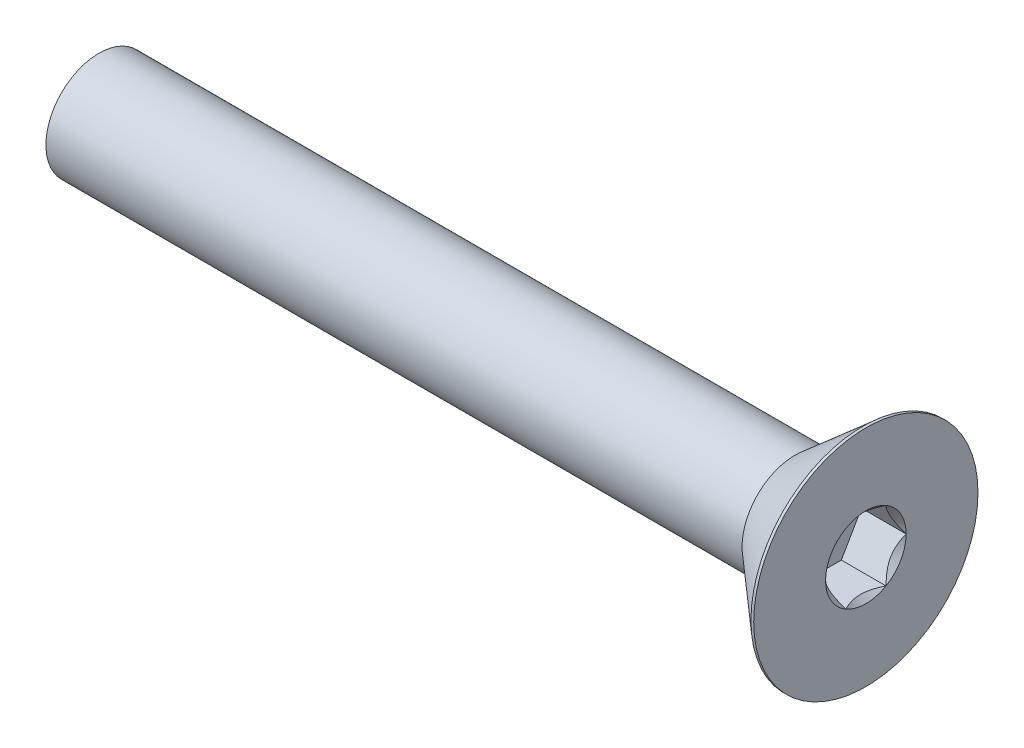
ISO-10303-21;
HEADER;
FILE_DESCRIPTION(('STEP AP214'),'2;1');
FILE_NAME('part.step','',(''),(''),'','','');
FILE_SCHEMA(('AUTOMOTIVE_DESIGN { 1 0 10303 214 1 1 1 1 }'));
ENDSEC;
DATA;
#1=APPLICATION_CONTEXT('core data for automotive mechanical design processes');
#2=APPLICATION_PROTOCOL_DEFINITION('international standard','automotive_design',2000,#1);
#3=PRODUCT_CONTEXT('',#1,'mechanical');
#4=PRODUCT('Part','Part','',(#3));
#5=PRODUCT_RELATED_PRODUCT_CATEGORY('part','',(#4));
#6=PRODUCT_DEFINITION_FORMATION('','',#4);
#7=PRODUCT_DEFINITION_CONTEXT('part definition',#1,'design');
#8=PRODUCT_DEFINITION('design','',#6,#7);
#9=PRODUCT_DEFINITION_SHAPE('','',#8);
#10=(LENGTH_UNIT() NAMED_UNIT(*) SI_UNIT(.MILLI.,.METRE.));
#11=(NAMED_UNIT(*) PLANE_ANGLE_UNIT() SI_UNIT($,.RADIAN.));
#12=(NAMED_UNIT(*) SI_UNIT($,.STERADIAN.) SOLID_ANGLE_UNIT());
#13=UNCERTAINTY_MEASURE_WITH_UNIT(LENGTH_MEASURE(1.E-05),#10,'distance_accuracy_value','');
#14=(GEOMETRIC_REPRESENTATION_CONTEXT(3) GLOBAL_UNCERTAINTY_ASSIGNED_CONTEXT((#13)) GLOBAL_UNIT_ASSIGNED_CONTEXT((#10,
#11,#12)) REPRESENTATION_CONTEXT('',''));
#15=CARTESIAN_POINT('',(0.,0.,0.));
#16=DIRECTION('',(0.,0.,1.));
#17=DIRECTION('',(1.,0.,0.));
#18=AXIS2_PLACEMENT_3D('',#15,#16,#17);
#19=CARTESIAN_POINT('',(1.193712867479,0.,0.));
#20=DIRECTION('',(1.,0.,0.));
#21=DIRECTION('',(0.,0.,-1.));
#22=AXIS2_PLACEMENT_3D('',#19,#20,#21);
#23=PLANE('',#22);
#24=DIRECTION('',(0.,-0.866025403784439,-0.5));
#25=VECTOR('',#24,1.);
#26=CARTESIAN_POINT('',(1.193712867479,-0.79375,1.3748153285078));
#27=LINE('',#26,#25);
#28=CARTESIAN_POINT('',(1.193712867479,0.,1.83308710467706));
#29=VERTEX_POINT('',#28);
#30=CARTESIAN_POINT('',(1.193712867479,-1.5875,0.916543552338532));
#31=VERTEX_POINT('',#30);
#32=EDGE_CURVE('E123',#29,#31,#27,.T.);
#33=ORIENTED_EDGE('',*,*,#32,.T.);
#34=DIRECTION('',(0.,0.,-1.));
#35=VECTOR('',#34,1.);
#36=CARTESIAN_POINT('',(1.193712867479,-1.5875,0.));
#37=LINE('',#36,#35);
#38=CARTESIAN_POINT('',(1.193712867479,-1.5875,-0.91654355233853));
#39=VERTEX_POINT('',#38);
#40=EDGE_CURVE('E90',#31,#39,#37,.T.);
#41=ORIENTED_EDGE('',*,*,#40,.T.);
#42=DIRECTION('',(0.,0.866025403784439,-0.5));
#43=VECTOR('',#42,1.);
#44=CARTESIAN_POINT('',(1.193712867479,-0.79375,-1.3748153285078));
#45=LINE('',#44,#43);
#46=CARTESIAN_POINT('',(1.193712867479,0.,-1.83308710467706));
#47=VERTEX_POINT('',#46);
#48=EDGE_CURVE('E92',#39,#47,#45,.T.);
#49=ORIENTED_EDGE('',*,*,#48,.T.);
#50=DIRECTION('',(0.,0.866025403784438,0.5));
#51=VECTOR('',#50,1.);
#52=CARTESIAN_POINT('',(1.193712867479,0.79375,-1.3748153285078));
#53=LINE('',#52,#51);
#54=CARTESIAN_POINT('',(1.193712867479,1.5875,-0.916543552338529));
#55=VERTEX_POINT('',#54);
#56=EDGE_CURVE('E93',#47,#55,#53,.T.);
#57=ORIENTED_EDGE('',*,*,#56,.T.);
#58=DIRECTION('',(0.,0.,1.));
#59=VECTOR('',#58,1.);
#60=CARTESIAN_POINT('',(1.193712867479,1.5875,0.));
#61=LINE('',#60,#59);
#62=CARTESIAN_POINT('',(1.193712867479,1.5875,0.916543552338531));
#63=VERTEX_POINT('',#62);
#64=EDGE_CURVE('E79',#55,#63,#61,.T.);
#65=ORIENTED_EDGE('',*,*,#64,.T.);
#66=DIRECTION('',(0.,-0.866025403784439,0.5));
#67=VECTOR('',#66,1.);
#68=CARTESIAN_POINT('',(1.193712867479,0.79375,1.3748153285078));
#69=LINE('',#68,#67);
#70=EDGE_CURVE('E118',#63,#29,#69,.T.);
#71=ORIENTED_EDGE('',*,*,#70,.T.);
#72=EDGE_LOOP('',(#33,#41,#49,#57,#65,#71));
#73=FACE_BOUND('',#72,.T.);
#74=ADVANCED_FACE('F25',(#73),#23,.T.);
#75=CARTESIAN_POINT('',(1.193712867479,0.79375,-1.3748153285078));
#76=DIRECTION('',(0.,0.5,-0.866025403784438));
#77=DIRECTION('',(0.,0.866025403784438,0.5));
#78=AXIS2_PLACEMENT_3D('',#75,#76,#77);
#79=PLANE('',#78);
#80=CARTESIAN_POINT('',(3.22571286750186,1.27190366490405E-11,-1.83308710467229));
#81=CARTESIAN_POINT('',(3.19424104986005,0.0545631502739884,-1.80158505517947));
#82=CARTESIAN_POINT('',(3.16461793028213,0.110038597583433,-1.76955629074127));
#83=CARTESIAN_POINT('',(3.11037926295554,0.223158727662726,-1.70424635318872));
#84=CARTESIAN_POINT('',(3.08579388372231,0.280814162284594,-1.67095897248972));
#85=CARTESIAN_POINT('',(3.04367896361078,0.39707351803509,-1.6038366021515));
#86=CARTESIAN_POINT('',(3.0260435970404,0.455647847371345,-1.57001869734156));
#87=CARTESIAN_POINT('',(2.99887295616836,0.574085662108213,-1.50163859312096));
#88=CARTESIAN_POINT('',(2.98931740761292,0.633945532003919,-1.46707848112303));
#89=CARTESIAN_POINT('',(2.98069560936949,0.737116774030597,-1.40751253676631));
#90=CARTESIAN_POINT('',(2.9794196892544,0.780294952191258,-1.38258360398213));
#91=CARTESIAN_POINT('',(2.98157200532222,0.866580665725205,-1.33276652404609));
#92=CARTESIAN_POINT('',(2.98500189035382,0.909688171036207,-1.30787839425069));
#93=CARTESIAN_POINT('',(2.99636918165353,0.995485199884442,-1.25834345654949));
#94=CARTESIAN_POINT('',(3.00431048768001,1.03817432925016,-1.23369687621872));
#95=CARTESIAN_POINT('',(3.02426914428968,1.12283605067518,-1.18481740856393));
#96=CARTESIAN_POINT('',(3.03628824374592,1.16480832716665,-1.16058470343308));
#97=CARTESIAN_POINT('',(3.0719566993385,1.27227527943506,-1.09853862961192));
#98=CARTESIAN_POINT('',(3.0982905750004,1.33710455598761,-1.06110942934294));
#99=CARTESIAN_POINT('',(3.14274348203233,1.43242888424927,-1.00607390276075));
#100=CARTESIAN_POINT('',(3.15836122675727,1.46384120989055,-0.987937988095882));
#101=CARTESIAN_POINT('',(3.19102231805198,1.52608848239935,-0.951999508556608));
#102=CARTESIAN_POINT('',(3.20806498626341,1.55692369555001,-0.934196789943556));
#103=CARTESIAN_POINT('',(3.22571286750293,1.58749999998813,-0.916543552345382));
#104=B_SPLINE_CURVE_WITH_KNOTS('',3,(#80,#81,#82,#83,#84,#85,#86,#87,#88,#89,#90,#91,#92,#93,
#94,#95,#96,#97,#98,#99,#100,#101,#102,#103),.UNSPECIFIED.,.F.,.F.,(4,2,2,2,2,2,2,2,2,2,2,4),
(0.,0.211427927693799,0.42408719707162,0.633370156309493,0.842126401366494,0.991537200904807,
1.14100036528198,1.29059292548924,1.44024972382122,1.67781721399119,1.79627069400735,
1.91466809992471),.UNSPECIFIED.);
#105=CARTESIAN_POINT('',(3.22571286750284,0.,-1.83308710467012));
#106=VERTEX_POINT('',#105);
#107=CARTESIAN_POINT('',(3.22571286750284,1.58749999999399,-0.916543552335056));
#108=VERTEX_POINT('',#107);
#109=EDGE_CURVE('E28',#106,#108,#104,.T.);
#110=ORIENTED_EDGE('',*,*,#109,.T.);
#111=DIRECTION('',(1.,0.,0.));
#112=VECTOR('',#111,1.);
#113=CARTESIAN_POINT('',(1.193712867479,1.5875,-0.916543552338529));
#114=LINE('',#113,#112);
#115=EDGE_CURVE('E98',#108,#55,#114,.F.);
#116=ORIENTED_EDGE('',*,*,#115,.T.);
#117=ORIENTED_EDGE('',*,*,#56,.F.);
#118=DIRECTION('',(1.,0.,0.));
#119=VECTOR('',#118,1.);
#120=CARTESIAN_POINT('',(1.193712867479,0.,-1.83308710467706));
#121=LINE('',#120,#119);
#122=EDGE_CURVE('E66',#47,#106,#121,.T.);
#123=ORIENTED_EDGE('',*,*,#122,.T.);
#124=EDGE_LOOP('',(#110,#116,#117,#123));
#125=FACE_BOUND('',#124,.T.);
#126=ADVANCED_FACE('F97',(#125),#79,.F.);
#127=CARTESIAN_POINT('',(1.193712867479,-0.79375,-1.3748153285078));
#128=DIRECTION('',(0.,-0.5,-0.866025403784439));
#129=DIRECTION('',(0.,0.866025403784439,-0.5));
#130=AXIS2_PLACEMENT_3D('',#127,#128,#129);
#131=PLANE('',#130);
#132=CARTESIAN_POINT('',(3.22571286750053,-1.58749999998325,-0.916543552347617));
#133=CARTESIAN_POINT('',(3.19424104985827,-1.53293684972208,-0.948045601839111));
#134=CARTESIAN_POINT('',(3.16461793028034,-1.47746140241289,-0.980074366276642));
#135=CARTESIAN_POINT('',(3.11037926295412,-1.36434127233427,-1.04538430382841));
#136=CARTESIAN_POINT('',(3.08579388372126,-1.30668583771283,-1.0786716845273));
#137=CARTESIAN_POINT('',(3.04367896361027,-1.19042648196318,-1.14579405486514));
#138=CARTESIAN_POINT('',(3.02604359704007,-1.13185215262735,-1.1796119596748));
#139=CARTESIAN_POINT('',(2.99887295616829,-1.01341433789136,-1.24799206389486));
#140=CARTESIAN_POINT('',(2.98931740761294,-0.9535544679961,-1.28255217589254));
#141=CARTESIAN_POINT('',(2.98069560936951,-0.850383225969922,-1.34211812024898));
#142=CARTESIAN_POINT('',(2.97941968925441,-0.807205047809308,-1.36704705303313));
#143=CARTESIAN_POINT('',(2.98157200532218,-0.720919334275457,-1.41686413296912));
#144=CARTESIAN_POINT('',(2.98500189035375,-0.677811828964505,-1.44175226276449));
#145=CARTESIAN_POINT('',(2.99636918165339,-0.592014800116357,-1.49128720046564));
#146=CARTESIAN_POINT('',(3.00431048767984,-0.549325670750674,-1.51593378079639));
#147=CARTESIAN_POINT('',(3.02426914428943,-0.464663949325729,-1.56481324845114));
#148=CARTESIAN_POINT('',(3.03628824374563,-0.422691672834298,-1.58904595358196));
#149=CARTESIAN_POINT('',(3.07195669933819,-0.315224720565743,-1.6510920274032));
#150=CARTESIAN_POINT('',(3.09829057500013,-0.25039544401301,-1.68852122767229));
#151=CARTESIAN_POINT('',(3.14274348203215,-0.15507111575111,-1.74355675425462));
#152=CARTESIAN_POINT('',(3.15836122675711,-0.123658790109747,-1.76169266891953));
#153=CARTESIAN_POINT('',(3.1910223180519,-0.0614115176007987,-1.7976311484589));
#154=CARTESIAN_POINT('',(3.20806498626337,-0.030576304450065,-1.81543386707199));
#155=CARTESIAN_POINT('',(3.22571286750293,-1.1869329529158E-11,-1.83308710467021));
#156=B_SPLINE_CURVE_WITH_KNOTS('',3,(#132,#133,#134,#135,#136,#137,#138,#139,#140,#141,#142,
#143,#144,#145,#146,#147,#148,#149,#150,#151,#152,#153,#154,#155),.UNSPECIFIED.,.F.,.F.,(4,2,2,
2,2,2,2,2,2,2,2,4),(0.,0.211427927692299,0.424087197068535,0.633370156304816,0.842126401360263,
0.991537200898412,1.14100036527541,1.29059292548253,1.44024972381435,1.67781721398494,
1.79627069400138,1.91466809991902),.UNSPECIFIED.);
#157=CARTESIAN_POINT('',(3.22571286747855,-1.58749999997296,-0.916543552322915));
#158=VERTEX_POINT('',#157);
#159=EDGE_CURVE('E102',#158,#106,#156,.T.);
#160=ORIENTED_EDGE('',*,*,#159,.T.);
#161=ORIENTED_EDGE('',*,*,#122,.F.);
#162=ORIENTED_EDGE('',*,*,#48,.F.);
#163=DIRECTION('',(1.,0.,0.));
#164=VECTOR('',#163,1.);
#165=CARTESIAN_POINT('',(1.193712867479,-1.5875,-0.91654355233853));
#166=LINE('',#165,#164);
#167=EDGE_CURVE('E104',#39,#158,#166,.T.);
#168=ORIENTED_EDGE('',*,*,#167,.T.);
#169=EDGE_LOOP('',(#160,#161,#162,#168));
#170=FACE_BOUND('',#169,.T.);
#171=ADVANCED_FACE('F100',(#170),#131,.F.);
#172=CARTESIAN_POINT('',(1.193712867479,-1.5875,0.));
#173=DIRECTION('',(0.,-1.,0.));
#174=DIRECTION('',(0.,0.,-1.));
#175=AXIS2_PLACEMENT_3D('',#172,#173,#174);
#176=PLANE('',#175);
#177=CARTESIAN_POINT('',(3.22571286750053,-1.5874999999995,0.916543552319482));
#178=CARTESIAN_POINT('',(3.19424104985925,-1.58749999999982,0.853539453324537));
#179=CARTESIAN_POINT('',(3.16461793028281,-1.58749999999995,0.789481924437113));
#180=CARTESIAN_POINT('',(3.11037926296095,-1.58750000000005,0.658862049308573));
#181=CARTESIAN_POINT('',(3.08579388373098,-1.58750000000001,0.592287287898146));
#182=CARTESIAN_POINT('',(3.04367896362744,-1.58749999999999,0.458042547197919));
#183=CARTESIAN_POINT('',(3.02604359706177,-1.5875,0.390406737566707));
#184=CARTESIAN_POINT('',(2.99887295620062,-1.5875,0.253646529103362));
#185=CARTESIAN_POINT('',(2.98931740765138,-1.5875,0.184526305096685));
#186=CARTESIAN_POINT('',(2.9806956094188,-1.5875,0.065394416357588));
#187=CARTESIAN_POINT('',(2.97941968930889,-1.5875,0.0155365507741219));
#188=CARTESIAN_POINT('',(2.98157200538873,-1.5875,-0.0840976091276274));
#189=CARTESIAN_POINT('',(2.98500189042718,-1.5875,-0.133873868732975));
#190=CARTESIAN_POINT('',(2.99636918174179,-1.5875,-0.232943744163808));
#191=CARTESIAN_POINT('',(3.00431048777632,-1.5875,-0.282236904839235));
#192=CARTESIAN_POINT('',(3.02426914440281,-1.5875,-0.379995840175979));
#193=CARTESIAN_POINT('',(3.03628824386782,-1.5875,-0.428461250450951));
#194=CARTESIAN_POINT('',(3.07195669946091,-1.5875,-0.552553398048427));
#195=CARTESIAN_POINT('',(3.09829057510559,-1.5875,-0.62741179853054));
#196=CARTESIAN_POINT('',(3.14274348210285,-1.5875,-0.737482851614946));
#197=CARTESIAN_POINT('',(3.15836122681472,-1.5875,-0.773754680918583));
#198=CARTESIAN_POINT('',(3.19102231808098,-1.5875,-0.845631639946218));
#199=CARTESIAN_POINT('',(3.20806498627704,-1.5875,-0.881237077147509));
#200=CARTESIAN_POINT('',(3.22571286750029,-1.5875,-0.916543552319548));
#201=B_SPLINE_CURVE_WITH_KNOTS('',3,(#177,#178,#179,#180,#181,#182,#183,#184,#185,#186,#187,
#188,#189,#190,#191,#192,#193,#194,#195,#196,#197,#198,#199,#200),.UNSPECIFIED.,.F.,.F.,(4,2,2,
2,2,2,2,2,2,2,2,4),(0.,0.211427927724625,0.424087197133195,0.633370156400541,0.842126401487028,
0.991537201070167,1.14100036549222,1.29059292574443,1.44024972412136,1.67781721411768,
1.79627069404646,1.91466809987682),.UNSPECIFIED.);
#202=CARTESIAN_POINT('',(3.22571286747855,-1.5875,0.916543552338532));
#203=VERTEX_POINT('',#202);
#204=EDGE_CURVE('E198',#203,#158,#201,.T.);
#205=ORIENTED_EDGE('',*,*,#204,.T.);
#206=ORIENTED_EDGE('',*,*,#167,.F.);
#207=ORIENTED_EDGE('',*,*,#40,.F.);
#208=DIRECTION('',(1.,0.,0.));
#209=VECTOR('',#208,1.);
#210=CARTESIAN_POINT('',(1.193712867479,-1.5875,0.916543552338532));
#211=LINE('',#210,#209);
#212=EDGE_CURVE('E120',#31,#203,#211,.T.);
#213=ORIENTED_EDGE('',*,*,#212,.T.);
#214=EDGE_LOOP('',(#205,#206,#207,#213));
#215=FACE_BOUND('',#214,.T.);
#216=ADVANCED_FACE('F207',(#215),#176,.F.);
#217=CARTESIAN_POINT('',(1.193712867479,-0.79375,1.3748153285078));
#218=DIRECTION('',(0.,-0.5,0.866025403784439));
#219=DIRECTION('',(0.,-0.866025403784439,-0.5));
#220=AXIS2_PLACEMENT_3D('',#217,#218,#219);
#221=PLANE('',#220);
#222=CARTESIAN_POINT('',(3.22571286750186,-1.27181945397336E-11,1.8330871046723));
#223=CARTESIAN_POINT('',(3.19424104986005,-0.0545631502739838,1.80158505517947));
#224=CARTESIAN_POINT('',(3.16461793028213,-0.110038597583424,1.76955629074127));
#225=CARTESIAN_POINT('',(3.11037926295555,-0.223158727662709,1.70424635318873));
#226=CARTESIAN_POINT('',(3.08579388372232,-0.280814162284573,1.67095897248974));
#227=CARTESIAN_POINT('',(3.04367896361078,-0.397073518035068,1.60383660215151));
#228=CARTESIAN_POINT('',(3.02604359704041,-0.455647847371328,1.57001869734157));
#229=CARTESIAN_POINT('',(2.99887295616836,-0.574085662108204,1.50163859312097));
#230=CARTESIAN_POINT('',(2.98931740761292,-0.633945532003914,1.46707848112304));
#231=CARTESIAN_POINT('',(2.98069560936948,-0.737116774030598,1.40751253676631));
#232=CARTESIAN_POINT('',(2.9794196892544,-0.780294952191261,1.38258360398213));
#233=CARTESIAN_POINT('',(2.98157200532222,-0.866580665725211,1.33276652404609));
#234=CARTESIAN_POINT('',(2.98500189035382,-0.909688171036214,1.30787839425069));
#235=CARTESIAN_POINT('',(2.99636918165353,-0.995485199884449,1.25834345654949));
#236=CARTESIAN_POINT('',(3.00431048768001,-1.03817432925017,1.23369687621872));
#237=CARTESIAN_POINT('',(3.02426914428968,-1.12283605067518,1.18481740856393));
#238=CARTESIAN_POINT('',(3.03628824374592,-1.16480832716665,1.16058470343308));
#239=CARTESIAN_POINT('',(3.07195669933823,-1.27227527943424,1.0985386296124));
#240=CARTESIAN_POINT('',(3.09829057499975,-1.337104555986,1.06110942934387));
#241=CARTESIAN_POINT('',(3.142743482031,-1.43242888424651,1.00607390276235));
#242=CARTESIAN_POINT('',(3.15836122675569,-1.46384120988742,0.987937988097692));
#243=CARTESIAN_POINT('',(3.19102231804989,-1.52608848239549,0.95199950855884));
#244=CARTESIAN_POINT('',(3.20806498626105,-1.55692369554579,0.934196789945994));
#245=CARTESIAN_POINT('',(3.22571286750029,-1.58749999998356,0.916543552348023));
#246=B_SPLINE_CURVE_WITH_KNOTS('',3,(#222,#223,#224,#225,#226,#227,#228,#229,#230,#231,#232,
#233,#234,#235,#236,#237,#238,#239,#240,#241,#242,#243,#244,#245),.UNSPECIFIED.,.F.,.F.,(4,2,2,
2,2,2,2,2,2,2,2,4),(0.,0.211427927693784,0.42408719707159,0.633370156309478,0.842126401366494,
0.991537200904813,1.14100036528199,1.29059292548925,1.44024972382122,1.67781721398823,
1.79627069400292,1.91466809991882),.UNSPECIFIED.);
#247=CARTESIAN_POINT('',(3.22571286750284,0.,1.83308710467012));
#248=VERTEX_POINT('',#247);
#249=EDGE_CURVE('E191',#248,#203,#246,.T.);
#250=ORIENTED_EDGE('',*,*,#249,.T.);
#251=ORIENTED_EDGE('',*,*,#212,.F.);
#252=ORIENTED_EDGE('',*,*,#32,.F.);
#253=DIRECTION('',(1.,0.,0.));
#254=VECTOR('',#253,1.);
#255=CARTESIAN_POINT('',(1.193712867479,0.,1.83308710467706));
#256=LINE('',#255,#254);
#257=EDGE_CURVE('E115',#29,#248,#256,.T.);
#258=ORIENTED_EDGE('',*,*,#257,.T.);
#259=EDGE_LOOP('',(#250,#251,#252,#258));
#260=FACE_BOUND('',#259,.T.);
#261=ADVANCED_FACE('F203',(#260),#221,.F.);
#262=CARTESIAN_POINT('',(1.193712867479,0.79375,1.3748153285078));
#263=DIRECTION('',(0.,0.5,0.866025403784439));
#264=DIRECTION('',(0.,-0.866025403784439,0.5));
#265=AXIS2_PLACEMENT_3D('',#262,#263,#264);
#266=PLANE('',#265);
#267=CARTESIAN_POINT('',(3.22571286750186,1.58749999998951,0.916543552347163));
#268=CARTESIAN_POINT('',(3.19424104986005,1.53293684972681,0.948045601837517));
#269=CARTESIAN_POINT('',(3.16461793028213,1.47746140241678,0.9800743662747));
#270=CARTESIAN_POINT('',(3.11037926295554,1.36434127233706,1.0453843038265));
#271=CARTESIAN_POINT('',(3.08579388372231,1.30668583771535,1.07867168452577));
#272=CARTESIAN_POINT('',(3.04367896361078,1.19042648196497,1.1457940548642));
#273=CARTESIAN_POINT('',(3.0260435970404,1.13185215262867,1.17961195967406));
#274=CARTESIAN_POINT('',(2.99887295616836,1.01341433789177,1.2479920638946));
#275=CARTESIAN_POINT('',(2.98931740761292,0.953554467996078,1.28255217589255));
#276=CARTESIAN_POINT('',(2.98069560936948,0.850383225969407,1.34211812024929));
#277=CARTESIAN_POINT('',(2.9794196892544,0.807205047808743,1.36704705303346));
#278=CARTESIAN_POINT('',(2.98157200532222,0.720919334274794,1.4168641329695));
#279=CARTESIAN_POINT('',(2.98500189035382,0.677811828963794,1.4417522627649));
#280=CARTESIAN_POINT('',(2.99636918165353,0.592014800115559,1.4912872004661));
#281=CARTESIAN_POINT('',(3.00431048768001,0.549325670749838,1.51593378079687));
#282=CARTESIAN_POINT('',(3.02426914428968,0.464663949324819,1.56481324845166));
#283=CARTESIAN_POINT('',(3.03628824374592,0.422691672833352,1.58904595358251));
#284=CARTESIAN_POINT('',(3.0719566993385,0.315224720564944,1.65109202740367));
#285=CARTESIAN_POINT('',(3.0982905750004,0.250395444012386,1.68852122767266));
#286=CARTESIAN_POINT('',(3.14274348203233,0.155071115750735,1.74355675425484));
#287=CARTESIAN_POINT('',(3.15836122675727,0.123658790109449,1.76169266891971));
#288=CARTESIAN_POINT('',(3.19102231805198,0.0614115176006523,1.79763114845898));
#289=CARTESIAN_POINT('',(3.20806498626341,0.0305763044499931,1.81543386707204));
#290=CARTESIAN_POINT('',(3.22571286750293,1.18705256372643E-11,1.83308710467021));
#291=B_SPLINE_CURVE_WITH_KNOTS('',3,(#267,#268,#269,#270,#271,#272,#273,#274,#275,#276,#277,
#278,#279,#280,#281,#282,#283,#284,#285,#286,#287,#288,#289,#290),.UNSPECIFIED.,.F.,.F.,(4,2,2,
2,2,2,2,2,2,2,2,4),(0.,0.211427927693799,0.42408719707162,0.633370156309492,0.842126401366493,
0.991537200904807,1.14100036528198,1.29059292548924,1.44024972382122,1.67781721399119,
1.79627069400735,1.91466809992471),.UNSPECIFIED.);
#292=CARTESIAN_POINT('',(3.22571286750284,1.58749999999399,0.91654355233506));
#293=VERTEX_POINT('',#292);
#294=EDGE_CURVE('E162',#293,#248,#291,.T.);
#295=ORIENTED_EDGE('',*,*,#294,.T.);
#296=ORIENTED_EDGE('',*,*,#257,.F.);
#297=ORIENTED_EDGE('',*,*,#70,.F.);
#298=DIRECTION('',(1.,0.,0.));
#299=VECTOR('',#298,1.);
#300=CARTESIAN_POINT('',(1.193712867479,1.5875,0.916543552338531));
#301=LINE('',#300,#299);
#302=EDGE_CURVE('E47',#63,#293,#301,.T.);
#303=ORIENTED_EDGE('',*,*,#302,.T.);
#304=EDGE_LOOP('',(#295,#296,#297,#303));
#305=FACE_BOUND('',#304,.T.);
#306=ADVANCED_FACE('F206',(#305),#266,.F.);
#307=CARTESIAN_POINT('',(1.193712867479,1.5875,0.));
#308=DIRECTION('',(0.,1.,0.));
#309=DIRECTION('',(0.,0.,1.));
#310=AXIS2_PLACEMENT_3D('',#307,#308,#309);
#311=PLANE('',#310);
#312=CARTESIAN_POINT('',(3.22571286750186,1.58750000000223,-0.91654355232513));
#313=CARTESIAN_POINT('',(3.19424104986005,1.5875000000008,-0.853539453341949));
#314=CARTESIAN_POINT('',(3.16461793028213,1.58750000000022,-0.789481924466565));
#315=CARTESIAN_POINT('',(3.11037926295554,1.58749999999978,-0.658862049362226));
#316=CARTESIAN_POINT('',(3.08579388372231,1.58749999999994,-0.592287287963956));
#317=CARTESIAN_POINT('',(3.04367896361078,1.58750000000006,-0.4580425472873));
#318=CARTESIAN_POINT('',(3.0260435970404,1.58750000000002,-0.390406737667498));
#319=CARTESIAN_POINT('',(2.99887295616836,1.58749999999999,-0.253646529226359));
#320=CARTESIAN_POINT('',(2.98931740761292,1.5875,-0.184526305230481));
#321=CARTESIAN_POINT('',(2.98069560936949,1.5875,-0.0653944165170242));
#322=CARTESIAN_POINT('',(2.9794196892544,1.5875,-0.0155365509486719));
#323=CARTESIAN_POINT('',(2.98157200532222,1.5875,0.0840976089234156));
#324=CARTESIAN_POINT('',(2.98500189035382,1.5875,0.133873868514215));
#325=CARTESIAN_POINT('',(2.99636918165353,1.5875,0.232943743916612));
#326=CARTESIAN_POINT('',(3.00431048768001,1.5875,0.282236904578152));
#327=CARTESIAN_POINT('',(3.02426914428968,1.5875,0.379995839887736));
#328=CARTESIAN_POINT('',(3.03628824374592,1.5875,0.428461250149434));
#329=CARTESIAN_POINT('',(3.0719566993385,1.5875,0.552553397791743));
#330=CARTESIAN_POINT('',(3.0982905750004,1.5875,0.627411798329719));
#331=CARTESIAN_POINT('',(3.14274348203233,1.5875,0.737482851494088));
#332=CARTESIAN_POINT('',(3.15836122675727,1.5875,0.773754680823825));
#333=CARTESIAN_POINT('',(3.19102231805198,1.5875,0.845631639902373));
#334=CARTESIAN_POINT('',(3.20806498626341,1.5875,0.881237077128478));
#335=CARTESIAN_POINT('',(3.22571286750293,1.5875,0.916543552324826));
#336=B_SPLINE_CURVE_WITH_KNOTS('',3,(#312,#313,#314,#315,#316,#317,#318,#319,#320,#321,#322,
#323,#324,#325,#326,#327,#328,#329,#330,#331,#332,#333,#334,#335),.UNSPECIFIED.,.F.,.F.,(4,2,2,
2,2,2,2,2,2,2,2,4),(0.,0.211427927693799,0.424087197071619,0.633370156309492,0.842126401366492,
0.991537200904806,1.14100036528198,1.29059292548924,1.44024972382121,1.67781721399119,
1.79627069400735,1.91466809992471),.UNSPECIFIED.);
#337=EDGE_CURVE('E155',#108,#293,#336,.T.);
#338=ORIENTED_EDGE('',*,*,#337,.T.);
#339=ORIENTED_EDGE('',*,*,#302,.F.);
#340=ORIENTED_EDGE('',*,*,#64,.F.);
#341=ORIENTED_EDGE('',*,*,#115,.F.);
#342=EDGE_LOOP('',(#338,#339,#340,#341));
#343=FACE_BOUND('',#342,.T.);
#344=ADVANCED_FACE('F169',(#343),#311,.F.);
#345=CARTESIAN_POINT('',(3.22571286739048,0.,0.));
#346=DIRECTION('',(1.,0.,0.));
#347=DIRECTION('',(0.,0.,-1.));
#348=AXIS2_PLACEMENT_3D('',#345,#346,#347);
#349=CONICAL_SURFACE('',#348,1.83308710455776,0.785398163397448);
#350=ORIENTED_EDGE('',*,*,#109,.F.);
#351=CARTESIAN_POINT('',(3.22571286750417,0.,0.));
#352=DIRECTION('',(1.,0.,0.));
#353=DIRECTION('',(0.,0.,-1.));
#354=AXIS2_PLACEMENT_3D('',#351,#352,#353);
#355=CIRCLE('',#354,1.83308710467145);
#356=EDGE_CURVE('E152',#108,#106,#355,.F.);
#357=ORIENTED_EDGE('',*,*,#356,.F.);
#358=EDGE_LOOP('',(#350,#357));
#359=FACE_BOUND('',#358,.T.);
#360=ADVANCED_FACE('F223',(#359),#349,.F.);
#361=CARTESIAN_POINT('',(3.22571286739048,0.,0.));
#362=DIRECTION('',(1.,0.,0.));
#363=DIRECTION('',(0.,0.,-1.));
#364=AXIS2_PLACEMENT_3D('',#361,#362,#363);
#365=CONICAL_SURFACE('',#364,1.83308710455776,0.785398163397448);
#366=ORIENTED_EDGE('',*,*,#159,.F.);
#367=CARTESIAN_POINT('',(3.22571286750417,0.,0.));
#368=DIRECTION('',(1.,0.,0.));
#369=DIRECTION('',(0.,0.,-1.));
#370=AXIS2_PLACEMENT_3D('',#367,#368,#369);
#371=CIRCLE('',#370,1.83308710467145);
#372=EDGE_CURVE('E149',#106,#158,#371,.F.);
#373=ORIENTED_EDGE('',*,*,#372,.F.);
#374=EDGE_LOOP('',(#366,#373));
#375=FACE_BOUND('',#374,.T.);
#376=ADVANCED_FACE('F220',(#375),#365,.F.);
#377=CARTESIAN_POINT('',(3.22571286739048,0.,0.));
#378=DIRECTION('',(1.,0.,0.));
#379=DIRECTION('',(0.,0.,-1.));
#380=AXIS2_PLACEMENT_3D('',#377,#378,#379);
#381=CONICAL_SURFACE('',#380,1.83308710455776,0.785398163512482);
#382=ORIENTED_EDGE('',*,*,#204,.F.);
#383=CARTESIAN_POINT('',(3.22571286744733,0.,0.));
#384=DIRECTION('',(1.,0.,0.));
#385=DIRECTION('',(0.,0.,-1.));
#386=AXIS2_PLACEMENT_3D('',#383,#384,#385);
#387=CIRCLE('',#386,1.83308710461461);
#388=EDGE_CURVE('E146',#158,#203,#387,.F.);
#389=ORIENTED_EDGE('',*,*,#388,.F.);
#390=EDGE_LOOP('',(#382,#389));
#391=FACE_BOUND('',#390,.T.);
#392=ADVANCED_FACE('F187',(#391),#381,.F.);
#393=CARTESIAN_POINT('',(3.22571286739048,0.,0.));
#394=DIRECTION('',(1.,0.,0.));
#395=DIRECTION('',(0.,0.,-1.));
#396=AXIS2_PLACEMENT_3D('',#393,#394,#395);
#397=CONICAL_SURFACE('',#396,1.83308710455776,0.785398163397448);
#398=ORIENTED_EDGE('',*,*,#249,.F.);
#399=CARTESIAN_POINT('',(3.22571286750417,0.,0.));
#400=DIRECTION('',(1.,0.,0.));
#401=DIRECTION('',(0.,0.,-1.));
#402=AXIS2_PLACEMENT_3D('',#399,#400,#401);
#403=CIRCLE('',#402,1.83308710467145);
#404=EDGE_CURVE('E143',#203,#248,#403,.F.);
#405=ORIENTED_EDGE('',*,*,#404,.F.);
#406=EDGE_LOOP('',(#398,#405));
#407=FACE_BOUND('',#406,.T.);
#408=ADVANCED_FACE('F182',(#407),#397,.F.);
#409=CARTESIAN_POINT('',(3.22571286739048,0.,0.));
#410=DIRECTION('',(1.,0.,0.));
#411=DIRECTION('',(0.,0.,-1.));
#412=AXIS2_PLACEMENT_3D('',#409,#410,#411);
#413=CONICAL_SURFACE('',#412,1.83308710455776,0.785398163397448);
#414=ORIENTED_EDGE('',*,*,#294,.F.);
#415=CARTESIAN_POINT('',(3.22571286750417,0.,0.));
#416=DIRECTION('',(1.,0.,0.));
#417=DIRECTION('',(0.,0.,-1.));
#418=AXIS2_PLACEMENT_3D('',#415,#416,#417);
#419=CIRCLE('',#418,1.83308710467145);
#420=EDGE_CURVE('E140',#248,#293,#419,.F.);
#421=ORIENTED_EDGE('',*,*,#420,.F.);
#422=EDGE_LOOP('',(#414,#421));
#423=FACE_BOUND('',#422,.T.);
#424=ADVANCED_FACE('F176',(#423),#413,.F.);
#425=CARTESIAN_POINT('',(3.22571286739048,0.,0.));
#426=DIRECTION('',(1.,0.,0.));
#427=DIRECTION('',(0.,0.,-1.));
#428=AXIS2_PLACEMENT_3D('',#425,#426,#427);
#429=CONICAL_SURFACE('',#428,1.83308710455776,0.785398163397448);
#430=ORIENTED_EDGE('',*,*,#337,.F.);
#431=CARTESIAN_POINT('',(3.22571286750417,0.,0.));
#432=DIRECTION('',(1.,0.,0.));
#433=DIRECTION('',(0.,0.,-1.));
#434=AXIS2_PLACEMENT_3D('',#431,#432,#433);
#435=CIRCLE('',#434,1.83308710467145);
#436=EDGE_CURVE('E137',#293,#108,#435,.F.);
#437=ORIENTED_EDGE('',*,*,#436,.F.);
#438=EDGE_LOOP('',(#430,#437));
#439=FACE_BOUND('',#438,.T.);
#440=ADVANCED_FACE('F171',(#439),#429,.F.);
#441=CARTESIAN_POINT('',(3.225712867479,0.,-5.10667));
#442=DIRECTION('',(1.,0.,0.));
#443=DIRECTION('',(0.,0.,-1.));
#444=AXIS2_PLACEMENT_3D('',#441,#442,#443);
#445=PLANE('',#444);
#446=CARTESIAN_POINT('',(3.225712867479,0.,0.));
#447=DIRECTION('',(1.,0.,0.));
#448=DIRECTION('',(0.,0.,-1.));
#449=AXIS2_PLACEMENT_3D('',#446,#447,#448);
#450=CIRCLE('',#449,5.10667);
#451=CARTESIAN_POINT('',(3.225712867479,0.,-5.10667));
#452=VERTEX_POINT('',#451);
#453=EDGE_CURVE('E134',#452,#452,#450,.F.);
#454=ORIENTED_EDGE('',*,*,#453,.F.);
#455=EDGE_LOOP('',(#454));
#456=FACE_BOUND('',#455,.T.);
#457=ORIENTED_EDGE('',*,*,#420,.T.);
#458=ORIENTED_EDGE('',*,*,#436,.T.);
#459=ORIENTED_EDGE('',*,*,#356,.T.);
#460=ORIENTED_EDGE('',*,*,#372,.T.);
#461=ORIENTED_EDGE('',*,*,#388,.T.);
#462=ORIENTED_EDGE('',*,*,#404,.T.);
#463=EDGE_LOOP('',(#457,#458,#459,#460,#461,#462));
#464=FACE_BOUND('',#463,.T.);
#465=ADVANCED_FACE('F175',(#456,#464),#445,.T.);
#466=CARTESIAN_POINT('',(3.225712867479,0.,0.));
#467=DIRECTION('',(1.,0.,0.));
#468=DIRECTION('',(0.,0.,-1.));
#469=AXIS2_PLACEMENT_3D('',#466,#467,#468);
#470=CYLINDRICAL_SURFACE('',#469,5.10667);
#471=ORIENTED_EDGE('',*,*,#453,.T.);
#472=EDGE_LOOP('',(#471));
#473=FACE_BOUND('',#472,.T.);
#474=CARTESIAN_POINT('',(3.09871286748375,0.,0.));
#475=DIRECTION('',(1.,0.,0.));
#476=DIRECTION('',(0.,0.,-1.));
#477=AXIS2_PLACEMENT_3D('',#474,#475,#476);
#478=CIRCLE('',#477,5.10666999997511);
#479=CARTESIAN_POINT('',(3.09871286748375,0.,-5.10666999997511));
#480=VERTEX_POINT('',#479);
#481=EDGE_CURVE('E133',#480,#480,#478,.F.);
#482=ORIENTED_EDGE('',*,*,#481,.F.);
#483=EDGE_LOOP('',(#482));
#484=FACE_BOUND('',#483,.T.);
#485=ADVANCED_FACE('F247',(#473,#484),#470,.T.);
#486=CARTESIAN_POINT('',(-31.6992,0.,0.));
#487=DIRECTION('',(-1.,0.,0.));
#488=DIRECTION('',(0.,0.,1.));
#489=AXIS2_PLACEMENT_3D('',#486,#487,#488);
#490=PLANE('',#489);
#491=CARTESIAN_POINT('',(-31.6992,0.,0.));
#492=DIRECTION('',(1.,0.,0.));
#493=DIRECTION('',(0.,0.,-1.));
#494=AXIS2_PLACEMENT_3D('',#491,#492,#493);
#495=CIRCLE('',#494,2.413);
#496=CARTESIAN_POINT('',(-31.6992,0.,-2.41300000000001));
#497=VERTEX_POINT('',#496);
#498=EDGE_CURVE('E38',#497,#497,#495,.T.);
#499=ORIENTED_EDGE('',*,*,#498,.F.);
#500=EDGE_LOOP('',(#499));
#501=FACE_BOUND('',#500,.T.);
#502=ADVANCED_FACE('F241',(#501),#490,.T.);
#503=CARTESIAN_POINT('',(3.09871286731322,0.,0.));
#504=DIRECTION('',(1.,0.,0.));
#505=DIRECTION('',(0.,0.,-1.));
#506=AXIS2_PLACEMENT_3D('',#503,#504,#505);
#507=CONICAL_SURFACE('',#506,5.10666999980458,0.71558499331418);
#508=ORIENTED_EDGE('',*,*,#481,.T.);
#509=EDGE_LOOP('',(#508));
#510=FACE_BOUND('',#509,.T.);
#511=CARTESIAN_POINT('',(0.,0.,0.));
#512=DIRECTION('',(1.,0.,0.));
#513=DIRECTION('',(0.,0.,-1.));
#514=AXIS2_PLACEMENT_3D('',#511,#512,#513);
#515=CIRCLE('',#514,2.413);
#516=CARTESIAN_POINT('',(0.,0.,-2.413));
#517=VERTEX_POINT('',#516);
#518=EDGE_CURVE('E13',#517,#517,#515,.F.);
#519=ORIENTED_EDGE('',*,*,#518,.F.);
#520=EDGE_LOOP('',(#519));
#521=FACE_BOUND('',#520,.T.);
#522=ADVANCED_FACE('F235',(#510,#521),#507,.T.);
#523=CARTESIAN_POINT('',(-31.6992,0.,0.));
#524=DIRECTION('',(1.,0.,0.));
#525=DIRECTION('',(0.,0.,-1.));
#526=AXIS2_PLACEMENT_3D('',#523,#524,#525);
#527=CYLINDRICAL_SURFACE('',#526,2.413);
#528=ORIENTED_EDGE('',*,*,#518,.T.);
#529=EDGE_LOOP('',(#528));
#530=FACE_BOUND('',#529,.T.);
#531=ORIENTED_EDGE('',*,*,#498,.T.);
#532=EDGE_LOOP('',(#531));
#533=FACE_BOUND('',#532,.T.);
#534=ADVANCED_FACE('F233',(#530,#533),#527,.T.);
#535=CLOSED_SHELL('',(#74,#126,#171,#216,#261,#306,#344,#360,#376,#392,#408,#424,#440,#465,#485,
#502,#522,#534));
#536=MANIFOLD_SOLID_BREP('B1',#535);
#537=ADVANCED_BREP_SHAPE_REPRESENTATION('',(#18,#536),#14);
#538=SHAPE_DEFINITION_REPRESENTATION(#9,#537);
ENDSEC;
END-ISO-10303-21;
